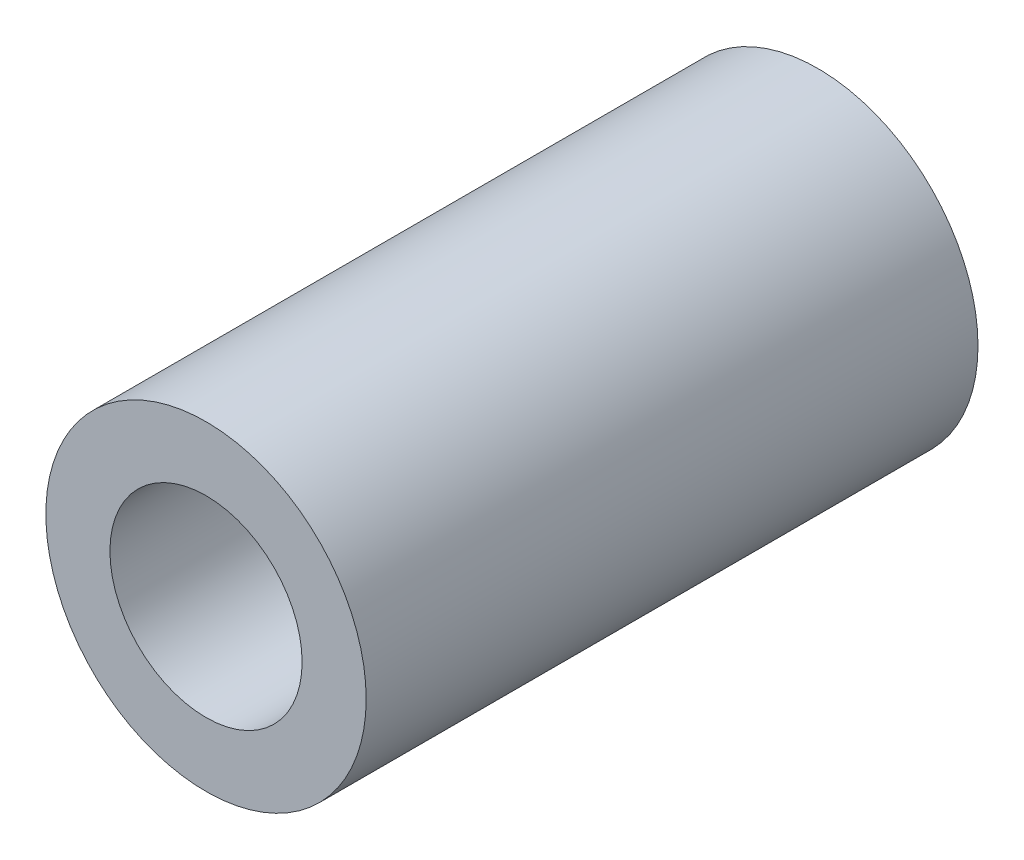
ISO-10303-21;
HEADER;
FILE_DESCRIPTION(('STEP AP214'),'2;1');
FILE_NAME('part.step','',(''),(''),'','','');
FILE_SCHEMA(('AUTOMOTIVE_DESIGN { 1 0 10303 214 1 1 1 1 }'));
ENDSEC;
DATA;
#1=APPLICATION_CONTEXT('core data for automotive mechanical design processes');
#2=APPLICATION_PROTOCOL_DEFINITION('international standard','automotive_design',2000,#1);
#3=PRODUCT_CONTEXT('',#1,'mechanical');
#4=PRODUCT('Part','Part','',(#3));
#5=PRODUCT_RELATED_PRODUCT_CATEGORY('part','',(#4));
#6=PRODUCT_DEFINITION_FORMATION('','',#4);
#7=PRODUCT_DEFINITION_CONTEXT('part definition',#1,'design');
#8=PRODUCT_DEFINITION('design','',#6,#7);
#9=PRODUCT_DEFINITION_SHAPE('','',#8);
#10=(LENGTH_UNIT() NAMED_UNIT(*) SI_UNIT(.MILLI.,.METRE.));
#11=(NAMED_UNIT(*) PLANE_ANGLE_UNIT() SI_UNIT($,.RADIAN.));
#12=(NAMED_UNIT(*) SI_UNIT($,.STERADIAN.) SOLID_ANGLE_UNIT());
#13=UNCERTAINTY_MEASURE_WITH_UNIT(LENGTH_MEASURE(1.E-05),#10,'distance_accuracy_value','');
#14=(GEOMETRIC_REPRESENTATION_CONTEXT(3) GLOBAL_UNCERTAINTY_ASSIGNED_CONTEXT((#13)) GLOBAL_UNIT_ASSIGNED_CONTEXT((#10,
#11,#12)) REPRESENTATION_CONTEXT('',''));
#15=CARTESIAN_POINT('',(0.,0.,0.));
#16=DIRECTION('',(0.,0.,1.));
#17=DIRECTION('',(1.,0.,0.));
#18=AXIS2_PLACEMENT_3D('',#15,#16,#17);
#19=CARTESIAN_POINT('',(0.,0.,9.55));
#20=DIRECTION('',(0.,0.,1.));
#21=DIRECTION('',(1.,0.,0.));
#22=AXIS2_PLACEMENT_3D('',#19,#20,#21);
#23=PLANE('',#22);
#24=CARTESIAN_POINT('',(0.,0.,9.55));
#25=DIRECTION('',(0.,0.,1.));
#26=DIRECTION('',(1.,0.,0.));
#27=AXIS2_PLACEMENT_3D('',#24,#25,#26);
#28=CIRCLE('',#27,2.5);
#29=CARTESIAN_POINT('',(2.5,0.,9.55));
#30=VERTEX_POINT('',#29);
#31=EDGE_CURVE('E10',#30,#30,#28,.T.);
#32=ORIENTED_EDGE('',*,*,#31,.T.);
#33=EDGE_LOOP('',(#32));
#34=FACE_BOUND('',#33,.T.);
#35=CARTESIAN_POINT('',(0.,0.,9.55));
#36=DIRECTION('',(0.,0.,1.));
#37=DIRECTION('',(1.,0.,0.));
#38=AXIS2_PLACEMENT_3D('',#35,#36,#37);
#39=CIRCLE('',#38,1.5);
#40=CARTESIAN_POINT('',(1.5,0.,9.55));
#41=VERTEX_POINT('',#40);
#42=EDGE_CURVE('E46',#41,#41,#39,.T.);
#43=ORIENTED_EDGE('',*,*,#42,.F.);
#44=EDGE_LOOP('',(#43));
#45=FACE_BOUND('',#44,.T.);
#46=ADVANCED_FACE('F35',(#34,#45),#23,.T.);
#47=CARTESIAN_POINT('',(0.,0.,0.));
#48=DIRECTION('',(0.,0.,1.));
#49=DIRECTION('',(1.,0.,0.));
#50=AXIS2_PLACEMENT_3D('',#47,#48,#49);
#51=PLANE('',#50);
#52=CARTESIAN_POINT('',(0.,0.,0.));
#53=DIRECTION('',(0.,0.,1.));
#54=DIRECTION('',(1.,0.,0.));
#55=AXIS2_PLACEMENT_3D('',#52,#53,#54);
#56=CIRCLE('',#55,2.5);
#57=CARTESIAN_POINT('',(2.5,0.,0.));
#58=VERTEX_POINT('',#57);
#59=EDGE_CURVE('E39',#58,#58,#56,.T.);
#60=ORIENTED_EDGE('',*,*,#59,.F.);
#61=EDGE_LOOP('',(#60));
#62=FACE_BOUND('',#61,.T.);
#63=CARTESIAN_POINT('',(0.,0.,0.));
#64=DIRECTION('',(0.,0.,1.));
#65=DIRECTION('',(1.,0.,0.));
#66=AXIS2_PLACEMENT_3D('',#63,#64,#65);
#67=CIRCLE('',#66,1.5);
#68=CARTESIAN_POINT('',(1.5,0.,0.));
#69=VERTEX_POINT('',#68);
#70=EDGE_CURVE('E48',#69,#69,#67,.T.);
#71=ORIENTED_EDGE('',*,*,#70,.T.);
#72=EDGE_LOOP('',(#71));
#73=FACE_BOUND('',#72,.T.);
#74=ADVANCED_FACE('F58',(#62,#73),#51,.F.);
#75=CARTESIAN_POINT('',(0.,0.,9.55));
#76=DIRECTION('',(0.,0.,-1.));
#77=DIRECTION('',(-1.,0.,0.));
#78=AXIS2_PLACEMENT_3D('',#75,#76,#77);
#79=CYLINDRICAL_SURFACE('',#78,2.5);
#80=ORIENTED_EDGE('',*,*,#31,.F.);
#81=EDGE_LOOP('',(#80));
#82=FACE_BOUND('',#81,.T.);
#83=ORIENTED_EDGE('',*,*,#59,.T.);
#84=EDGE_LOOP('',(#83));
#85=FACE_BOUND('',#84,.T.);
#86=ADVANCED_FACE('F37',(#82,#85),#79,.T.);
#87=CARTESIAN_POINT('',(0.,0.,9.55));
#88=DIRECTION('',(0.,0.,-1.));
#89=DIRECTION('',(-1.,0.,0.));
#90=AXIS2_PLACEMENT_3D('',#87,#88,#89);
#91=CYLINDRICAL_SURFACE('',#90,1.5);
#92=ORIENTED_EDGE('',*,*,#42,.T.);
#93=EDGE_LOOP('',(#92));
#94=FACE_BOUND('',#93,.T.);
#95=ORIENTED_EDGE('',*,*,#70,.F.);
#96=EDGE_LOOP('',(#95));
#97=FACE_BOUND('',#96,.T.);
#98=ADVANCED_FACE('F54',(#94,#97),#91,.F.);
#99=CLOSED_SHELL('',(#46,#74,#86,#98));
#100=MANIFOLD_SOLID_BREP('B2',#99);
#101=ADVANCED_BREP_SHAPE_REPRESENTATION('',(#18,#100),#14);
#102=SHAPE_DEFINITION_REPRESENTATION(#9,#101);
ENDSEC;
END-ISO-10303-21;
